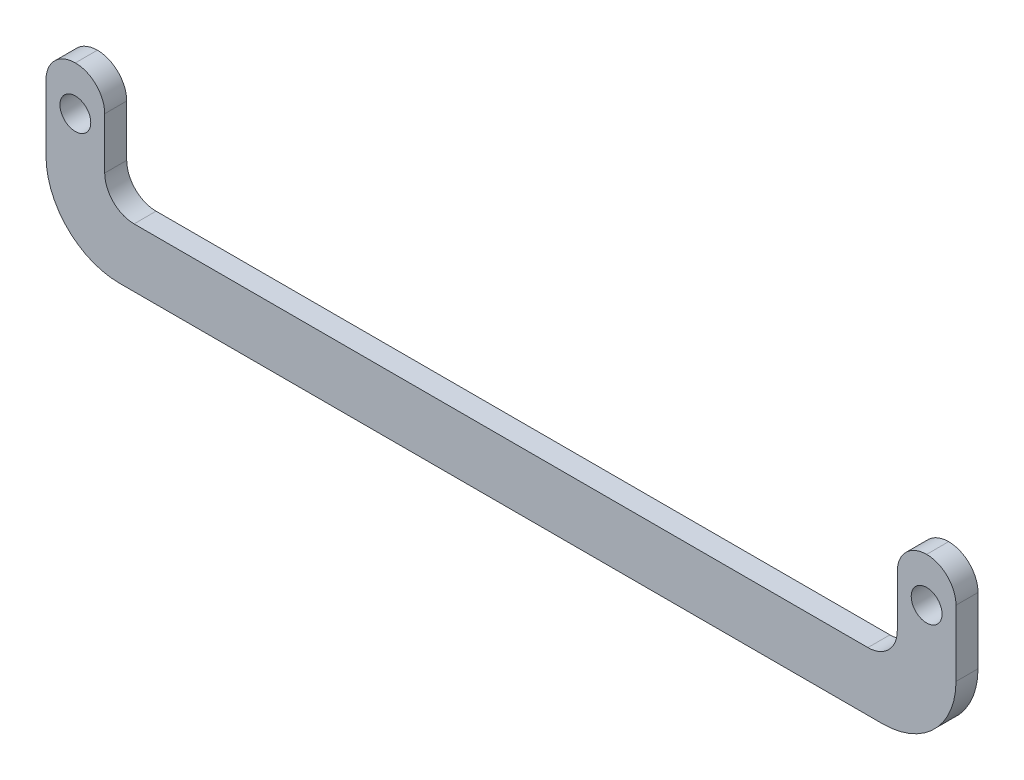
ISO-10303-21;
HEADER;
FILE_DESCRIPTION(('STEP AP214'),'2;1');
FILE_NAME('part.step','',(''),(''),'','','');
FILE_SCHEMA(('AUTOMOTIVE_DESIGN { 1 0 10303 214 1 1 1 1 }'));
ENDSEC;
DATA;
#1=APPLICATION_CONTEXT('core data for automotive mechanical design processes');
#2=APPLICATION_PROTOCOL_DEFINITION('international standard','automotive_design',2000,#1);
#3=PRODUCT_CONTEXT('',#1,'mechanical');
#4=PRODUCT('Part','Part','',(#3));
#5=PRODUCT_RELATED_PRODUCT_CATEGORY('part','',(#4));
#6=PRODUCT_DEFINITION_FORMATION('','',#4);
#7=PRODUCT_DEFINITION_CONTEXT('part definition',#1,'design');
#8=PRODUCT_DEFINITION('design','',#6,#7);
#9=PRODUCT_DEFINITION_SHAPE('','',#8);
#10=(LENGTH_UNIT() NAMED_UNIT(*) SI_UNIT(.MILLI.,.METRE.));
#11=(NAMED_UNIT(*) PLANE_ANGLE_UNIT() SI_UNIT($,.RADIAN.));
#12=(NAMED_UNIT(*) SI_UNIT($,.STERADIAN.) SOLID_ANGLE_UNIT());
#13=UNCERTAINTY_MEASURE_WITH_UNIT(LENGTH_MEASURE(1.E-05),#10,'distance_accuracy_value','');
#14=(GEOMETRIC_REPRESENTATION_CONTEXT(3) GLOBAL_UNCERTAINTY_ASSIGNED_CONTEXT((#13)) GLOBAL_UNIT_ASSIGNED_CONTEXT((#10,
#11,#12)) REPRESENTATION_CONTEXT('',''));
#15=CARTESIAN_POINT('',(0.,0.,0.));
#16=DIRECTION('',(0.,0.,1.));
#17=DIRECTION('',(1.,0.,0.));
#18=AXIS2_PLACEMENT_3D('',#15,#16,#17);
#19=CARTESIAN_POINT('',(-62.,4.,3.));
#20=DIRECTION('',(0.,-1.,0.));
#21=DIRECTION('',(0.,0.,-1.));
#22=AXIS2_PLACEMENT_3D('',#19,#20,#21);
#23=PLANE('',#22);
#24=DIRECTION('',(-1.,0.,0.));
#25=VECTOR('',#24,1.);
#26=CARTESIAN_POINT('',(-62.,4.,0.));
#27=LINE('',#26,#25);
#28=CARTESIAN_POINT('',(50.,4.,0.));
#29=VERTEX_POINT('',#28);
#30=CARTESIAN_POINT('',(-50.,4.,0.));
#31=VERTEX_POINT('',#30);
#32=EDGE_CURVE('E165',#29,#31,#27,.T.);
#33=ORIENTED_EDGE('',*,*,#32,.T.);
#34=DIRECTION('',(0.,0.,1.));
#35=VECTOR('',#34,1.);
#36=CARTESIAN_POINT('',(-50.,4.,3.));
#37=LINE('',#36,#35);
#38=CARTESIAN_POINT('',(-50.,4.,3.));
#39=VERTEX_POINT('',#38);
#40=EDGE_CURVE('E194',#31,#39,#37,.T.);
#41=ORIENTED_EDGE('',*,*,#40,.T.);
#42=DIRECTION('',(-1.,0.,0.));
#43=VECTOR('',#42,1.);
#44=CARTESIAN_POINT('',(-62.,4.,3.));
#45=LINE('',#44,#43);
#46=CARTESIAN_POINT('',(50.,4.,3.));
#47=VERTEX_POINT('',#46);
#48=EDGE_CURVE('E253',#47,#39,#45,.T.);
#49=ORIENTED_EDGE('',*,*,#48,.F.);
#50=DIRECTION('',(0.,0.,1.));
#51=VECTOR('',#50,1.);
#52=CARTESIAN_POINT('',(50.,4.,0.));
#53=LINE('',#52,#51);
#54=EDGE_CURVE('E192',#47,#29,#53,.F.);
#55=ORIENTED_EDGE('',*,*,#54,.T.);
#56=EDGE_LOOP('',(#33,#41,#49,#55));
#57=FACE_BOUND('',#56,.T.);
#58=ADVANCED_FACE('F35',(#57),#23,.F.);
#59=CARTESIAN_POINT('',(62.,-4.,3.));
#60=DIRECTION('',(-1.,0.,0.));
#61=DIRECTION('',(0.,0.,1.));
#62=AXIS2_PLACEMENT_3D('',#59,#60,#61);
#63=PLANE('',#62);
#64=DIRECTION('',(0.,1.,0.));
#65=VECTOR('',#64,1.);
#66=CARTESIAN_POINT('',(62.,-4.,0.));
#67=LINE('',#66,#65);
#68=CARTESIAN_POINT('',(62.,6.,0.));
#69=VERTEX_POINT('',#68);
#70=CARTESIAN_POINT('',(62.,15.,0.));
#71=VERTEX_POINT('',#70);
#72=EDGE_CURVE('E155',#69,#71,#67,.T.);
#73=ORIENTED_EDGE('',*,*,#72,.T.);
#74=DIRECTION('',(0.,0.,1.));
#75=VECTOR('',#74,1.);
#76=CARTESIAN_POINT('',(62.,15.,3.));
#77=LINE('',#76,#75);
#78=CARTESIAN_POINT('',(62.,15.,3.));
#79=VERTEX_POINT('',#78);
#80=EDGE_CURVE('E207',#71,#79,#77,.T.);
#81=ORIENTED_EDGE('',*,*,#80,.T.);
#82=DIRECTION('',(0.,1.,0.));
#83=VECTOR('',#82,1.);
#84=CARTESIAN_POINT('',(62.,-4.,3.));
#85=LINE('',#84,#83);
#86=CARTESIAN_POINT('',(62.,6.,3.));
#87=VERTEX_POINT('',#86);
#88=EDGE_CURVE('E158',#87,#79,#85,.T.);
#89=ORIENTED_EDGE('',*,*,#88,.F.);
#90=DIRECTION('',(0.,0.,-1.));
#91=VECTOR('',#90,1.);
#92=CARTESIAN_POINT('',(62.,6.,3.));
#93=LINE('',#92,#91);
#94=EDGE_CURVE('E142',#87,#69,#93,.T.);
#95=ORIENTED_EDGE('',*,*,#94,.T.);
#96=EDGE_LOOP('',(#73,#81,#89,#95));
#97=FACE_BOUND('',#96,.T.);
#98=ADVANCED_FACE('F153',(#97),#63,.F.);
#99=CARTESIAN_POINT('',(-62.,-4.,3.));
#100=DIRECTION('',(1.,0.,0.));
#101=DIRECTION('',(0.,0.,-1.));
#102=AXIS2_PLACEMENT_3D('',#99,#100,#101);
#103=PLANE('',#102);
#104=DIRECTION('',(0.,-1.,0.));
#105=VECTOR('',#104,1.);
#106=CARTESIAN_POINT('',(-62.,-4.,3.));
#107=LINE('',#106,#105);
#108=CARTESIAN_POINT('',(-62.,15.,3.));
#109=VERTEX_POINT('',#108);
#110=CARTESIAN_POINT('',(-62.,6.,3.));
#111=VERTEX_POINT('',#110);
#112=EDGE_CURVE('E247',#109,#111,#107,.T.);
#113=ORIENTED_EDGE('',*,*,#112,.F.);
#114=DIRECTION('',(0.,0.,1.));
#115=VECTOR('',#114,1.);
#116=CARTESIAN_POINT('',(-62.,15.,0.));
#117=LINE('',#116,#115);
#118=CARTESIAN_POINT('',(-62.,15.,0.));
#119=VERTEX_POINT('',#118);
#120=EDGE_CURVE('E222',#109,#119,#117,.F.);
#121=ORIENTED_EDGE('',*,*,#120,.T.);
#122=DIRECTION('',(0.,-1.,0.));
#123=VECTOR('',#122,1.);
#124=CARTESIAN_POINT('',(-62.,-4.,0.));
#125=LINE('',#124,#123);
#126=CARTESIAN_POINT('',(-62.,6.,0.));
#127=VERTEX_POINT('',#126);
#128=EDGE_CURVE('E169',#119,#127,#125,.T.);
#129=ORIENTED_EDGE('',*,*,#128,.T.);
#130=DIRECTION('',(0.,0.,-1.));
#131=VECTOR('',#130,1.);
#132=CARTESIAN_POINT('',(-62.,6.,3.));
#133=LINE('',#132,#131);
#134=EDGE_CURVE('E189',#127,#111,#133,.F.);
#135=ORIENTED_EDGE('',*,*,#134,.T.);
#136=EDGE_LOOP('',(#113,#121,#129,#135));
#137=FACE_BOUND('',#136,.T.);
#138=ADVANCED_FACE('F250',(#137),#103,.F.);
#139=CARTESIAN_POINT('',(-62.,-4.,3.));
#140=DIRECTION('',(0.,1.,0.));
#141=DIRECTION('',(0.,0.,1.));
#142=AXIS2_PLACEMENT_3D('',#139,#140,#141);
#143=PLANE('',#142);
#144=DIRECTION('',(1.,0.,0.));
#145=VECTOR('',#144,1.);
#146=CARTESIAN_POINT('',(-62.,-4.,0.));
#147=LINE('',#146,#145);
#148=CARTESIAN_POINT('',(-52.,-4.,0.));
#149=VERTEX_POINT('',#148);
#150=CARTESIAN_POINT('',(52.,-4.,0.));
#151=VERTEX_POINT('',#150);
#152=EDGE_CURVE('E178',#149,#151,#147,.T.);
#153=ORIENTED_EDGE('',*,*,#152,.T.);
#154=DIRECTION('',(0.,0.,-1.));
#155=VECTOR('',#154,1.);
#156=CARTESIAN_POINT('',(52.,-4.,3.));
#157=LINE('',#156,#155);
#158=CARTESIAN_POINT('',(52.,-4.,3.));
#159=VERTEX_POINT('',#158);
#160=EDGE_CURVE('E143',#151,#159,#157,.F.);
#161=ORIENTED_EDGE('',*,*,#160,.T.);
#162=DIRECTION('',(1.,0.,0.));
#163=VECTOR('',#162,1.);
#164=CARTESIAN_POINT('',(-62.,-4.,3.));
#165=LINE('',#164,#163);
#166=CARTESIAN_POINT('',(-52.,-4.,3.));
#167=VERTEX_POINT('',#166);
#168=EDGE_CURVE('E159',#167,#159,#165,.T.);
#169=ORIENTED_EDGE('',*,*,#168,.F.);
#170=DIRECTION('',(0.,0.,-1.));
#171=VECTOR('',#170,1.);
#172=CARTESIAN_POINT('',(-52.,-4.,3.));
#173=LINE('',#172,#171);
#174=EDGE_CURVE('E147',#167,#149,#173,.T.);
#175=ORIENTED_EDGE('',*,*,#174,.T.);
#176=EDGE_LOOP('',(#153,#161,#169,#175));
#177=FACE_BOUND('',#176,.T.);
#178=ADVANCED_FACE('F287',(#177),#143,.F.);
#179=CARTESIAN_POINT('',(0.,0.,3.));
#180=DIRECTION('',(0.,0.,-1.));
#181=DIRECTION('',(-1.,0.,0.));
#182=AXIS2_PLACEMENT_3D('',#179,#180,#181);
#183=PLANE('',#182);
#184=CARTESIAN_POINT('',(58.,13.,3.));
#185=DIRECTION('',(0.,0.,-1.));
#186=DIRECTION('',(-1.,0.,0.));
#187=AXIS2_PLACEMENT_3D('',#184,#185,#186);
#188=CIRCLE('',#187,2.1);
#189=CARTESIAN_POINT('',(55.9,13.,3.));
#190=VERTEX_POINT('',#189);
#191=EDGE_CURVE('E230',#190,#190,#188,.T.);
#192=ORIENTED_EDGE('',*,*,#191,.T.);
#193=EDGE_LOOP('',(#192));
#194=FACE_BOUND('',#193,.T.);
#195=ORIENTED_EDGE('',*,*,#88,.T.);
#196=CARTESIAN_POINT('',(58.,15.,3.));
#197=DIRECTION('',(0.,0.,-1.));
#198=DIRECTION('',(-1.,0.,0.));
#199=AXIS2_PLACEMENT_3D('',#196,#197,#198);
#200=CIRCLE('',#199,4.);
#201=CARTESIAN_POINT('',(58.,19.,3.));
#202=VERTEX_POINT('',#201);
#203=EDGE_CURVE('E215',#79,#202,#200,.F.);
#204=ORIENTED_EDGE('',*,*,#203,.T.);
#205=CARTESIAN_POINT('',(58.,15.,3.));
#206=DIRECTION('',(0.,0.,-1.));
#207=DIRECTION('',(-1.,0.,0.));
#208=AXIS2_PLACEMENT_3D('',#205,#206,#207);
#209=CIRCLE('',#208,4.);
#210=CARTESIAN_POINT('',(54.,15.,3.));
#211=VERTEX_POINT('',#210);
#212=EDGE_CURVE('E213',#202,#211,#209,.F.);
#213=ORIENTED_EDGE('',*,*,#212,.T.);
#214=DIRECTION('',(0.,1.,0.));
#215=VECTOR('',#214,1.);
#216=CARTESIAN_POINT('',(54.,-4.,3.));
#217=LINE('',#216,#215);
#218=CARTESIAN_POINT('',(54.,8.,3.));
#219=VERTEX_POINT('',#218);
#220=EDGE_CURVE('E267',#219,#211,#217,.T.);
#221=ORIENTED_EDGE('',*,*,#220,.F.);
#222=CARTESIAN_POINT('',(50.,8.,3.));
#223=DIRECTION('',(0.,0.,-1.));
#224=DIRECTION('',(-1.,0.,0.));
#225=AXIS2_PLACEMENT_3D('',#222,#223,#224);
#226=CIRCLE('',#225,4.);
#227=EDGE_CURVE('E44',#219,#47,#226,.T.);
#228=ORIENTED_EDGE('',*,*,#227,.T.);
#229=ORIENTED_EDGE('',*,*,#48,.T.);
#230=CARTESIAN_POINT('',(-50.,8.,3.));
#231=DIRECTION('',(0.,0.,-1.));
#232=DIRECTION('',(-1.,0.,0.));
#233=AXIS2_PLACEMENT_3D('',#230,#231,#232);
#234=CIRCLE('',#233,4.);
#235=CARTESIAN_POINT('',(-54.,8.,3.));
#236=VERTEX_POINT('',#235);
#237=EDGE_CURVE('E224',#39,#236,#234,.T.);
#238=ORIENTED_EDGE('',*,*,#237,.T.);
#239=DIRECTION('',(0.,1.,0.));
#240=VECTOR('',#239,1.);
#241=CARTESIAN_POINT('',(-54.,-4.,3.));
#242=LINE('',#241,#240);
#243=CARTESIAN_POINT('',(-54.,15.,3.));
#244=VERTEX_POINT('',#243);
#245=EDGE_CURVE('E172',#236,#244,#242,.T.);
#246=ORIENTED_EDGE('',*,*,#245,.T.);
#247=CARTESIAN_POINT('',(-58.,15.,3.));
#248=DIRECTION('',(0.,0.,-1.));
#249=DIRECTION('',(-1.,0.,0.));
#250=AXIS2_PLACEMENT_3D('',#247,#248,#249);
#251=CIRCLE('',#250,4.);
#252=CARTESIAN_POINT('',(-58.,19.,3.));
#253=VERTEX_POINT('',#252);
#254=EDGE_CURVE('E211',#244,#253,#251,.F.);
#255=ORIENTED_EDGE('',*,*,#254,.T.);
#256=CARTESIAN_POINT('',(-58.,15.,3.));
#257=DIRECTION('',(0.,0.,-1.));
#258=DIRECTION('',(-1.,0.,0.));
#259=AXIS2_PLACEMENT_3D('',#256,#257,#258);
#260=CIRCLE('',#259,4.);
#261=EDGE_CURVE('E209',#253,#109,#260,.F.);
#262=ORIENTED_EDGE('',*,*,#261,.T.);
#263=ORIENTED_EDGE('',*,*,#112,.T.);
#264=CARTESIAN_POINT('',(-52.,6.,3.));
#265=DIRECTION('',(0.,0.,-1.));
#266=DIRECTION('',(-1.,0.,0.));
#267=AXIS2_PLACEMENT_3D('',#264,#265,#266);
#268=CIRCLE('',#267,10.);
#269=EDGE_CURVE('E185',#111,#167,#268,.F.);
#270=ORIENTED_EDGE('',*,*,#269,.T.);
#271=ORIENTED_EDGE('',*,*,#168,.T.);
#272=CARTESIAN_POINT('',(52.,6.,3.));
#273=DIRECTION('',(0.,0.,-1.));
#274=DIRECTION('',(-1.,0.,0.));
#275=AXIS2_PLACEMENT_3D('',#272,#273,#274);
#276=CIRCLE('',#275,10.);
#277=EDGE_CURVE('E187',#159,#87,#276,.F.);
#278=ORIENTED_EDGE('',*,*,#277,.T.);
#279=EDGE_LOOP('',(#195,#204,#213,#221,#228,#229,#238,#246,#255,#262,#263,#270,#271,#278));
#280=FACE_BOUND('',#279,.T.);
#281=CARTESIAN_POINT('',(-58.,13.,3.));
#282=DIRECTION('',(0.,0.,1.));
#283=DIRECTION('',(1.,0.,0.));
#284=AXIS2_PLACEMENT_3D('',#281,#282,#283);
#285=CIRCLE('',#284,2.1);
#286=CARTESIAN_POINT('',(-55.9,13.,3.));
#287=VERTEX_POINT('',#286);
#288=EDGE_CURVE('E261',#287,#287,#285,.T.);
#289=ORIENTED_EDGE('',*,*,#288,.F.);
#290=EDGE_LOOP('',(#289));
#291=FACE_BOUND('',#290,.T.);
#292=ADVANCED_FACE('F245',(#194,#280,#291),#183,.F.);
#293=CARTESIAN_POINT('',(0.,0.,0.));
#294=DIRECTION('',(0.,0.,-1.));
#295=DIRECTION('',(-1.,0.,0.));
#296=AXIS2_PLACEMENT_3D('',#293,#294,#295);
#297=PLANE('',#296);
#298=CARTESIAN_POINT('',(58.,13.,0.));
#299=DIRECTION('',(0.,0.,-1.));
#300=DIRECTION('',(-1.,0.,0.));
#301=AXIS2_PLACEMENT_3D('',#298,#299,#300);
#302=CIRCLE('',#301,2.1);
#303=CARTESIAN_POINT('',(55.9,13.,0.));
#304=VERTEX_POINT('',#303);
#305=EDGE_CURVE('E233',#304,#304,#302,.T.);
#306=ORIENTED_EDGE('',*,*,#305,.F.);
#307=EDGE_LOOP('',(#306));
#308=FACE_BOUND('',#307,.T.);
#309=CARTESIAN_POINT('',(58.,15.,0.));
#310=DIRECTION('',(0.,0.,-1.));
#311=DIRECTION('',(-1.,0.,0.));
#312=AXIS2_PLACEMENT_3D('',#309,#310,#311);
#313=CIRCLE('',#312,4.);
#314=CARTESIAN_POINT('',(54.,15.,0.));
#315=VERTEX_POINT('',#314);
#316=CARTESIAN_POINT('',(58.,19.,0.));
#317=VERTEX_POINT('',#316);
#318=EDGE_CURVE('E52',#315,#317,#313,.T.);
#319=ORIENTED_EDGE('',*,*,#318,.T.);
#320=CARTESIAN_POINT('',(58.,15.,0.));
#321=DIRECTION('',(0.,0.,-1.));
#322=DIRECTION('',(-1.,0.,0.));
#323=AXIS2_PLACEMENT_3D('',#320,#321,#322);
#324=CIRCLE('',#323,4.);
#325=EDGE_CURVE('E164',#317,#71,#324,.T.);
#326=ORIENTED_EDGE('',*,*,#325,.T.);
#327=ORIENTED_EDGE('',*,*,#72,.F.);
#328=CARTESIAN_POINT('',(52.,6.,0.));
#329=DIRECTION('',(0.,0.,-1.));
#330=DIRECTION('',(-1.,0.,0.));
#331=AXIS2_PLACEMENT_3D('',#328,#329,#330);
#332=CIRCLE('',#331,10.);
#333=EDGE_CURVE('E138',#69,#151,#332,.T.);
#334=ORIENTED_EDGE('',*,*,#333,.T.);
#335=ORIENTED_EDGE('',*,*,#152,.F.);
#336=CARTESIAN_POINT('',(-52.,6.,0.));
#337=DIRECTION('',(0.,0.,-1.));
#338=DIRECTION('',(-1.,0.,0.));
#339=AXIS2_PLACEMENT_3D('',#336,#337,#338);
#340=CIRCLE('',#339,10.);
#341=EDGE_CURVE('E148',#149,#127,#340,.T.);
#342=ORIENTED_EDGE('',*,*,#341,.T.);
#343=ORIENTED_EDGE('',*,*,#128,.F.);
#344=CARTESIAN_POINT('',(-58.,15.,0.));
#345=DIRECTION('',(0.,0.,-1.));
#346=DIRECTION('',(-1.,0.,0.));
#347=AXIS2_PLACEMENT_3D('',#344,#345,#346);
#348=CIRCLE('',#347,4.);
#349=CARTESIAN_POINT('',(-58.,19.,0.));
#350=VERTEX_POINT('',#349);
#351=EDGE_CURVE('E59',#119,#350,#348,.T.);
#352=ORIENTED_EDGE('',*,*,#351,.T.);
#353=CARTESIAN_POINT('',(-58.,15.,0.));
#354=DIRECTION('',(0.,0.,-1.));
#355=DIRECTION('',(-1.,0.,0.));
#356=AXIS2_PLACEMENT_3D('',#353,#354,#355);
#357=CIRCLE('',#356,4.);
#358=CARTESIAN_POINT('',(-54.,15.,0.));
#359=VERTEX_POINT('',#358);
#360=EDGE_CURVE('E218',#350,#359,#357,.T.);
#361=ORIENTED_EDGE('',*,*,#360,.T.);
#362=DIRECTION('',(0.,1.,0.));
#363=VECTOR('',#362,1.);
#364=CARTESIAN_POINT('',(-54.,-4.,0.));
#365=LINE('',#364,#363);
#366=CARTESIAN_POINT('',(-54.,8.,0.));
#367=VERTEX_POINT('',#366);
#368=EDGE_CURVE('E166',#367,#359,#365,.T.);
#369=ORIENTED_EDGE('',*,*,#368,.F.);
#370=CARTESIAN_POINT('',(-50.,8.,0.));
#371=DIRECTION('',(0.,0.,-1.));
#372=DIRECTION('',(-1.,0.,0.));
#373=AXIS2_PLACEMENT_3D('',#370,#371,#372);
#374=CIRCLE('',#373,4.);
#375=EDGE_CURVE('E226',#367,#31,#374,.F.);
#376=ORIENTED_EDGE('',*,*,#375,.T.);
#377=ORIENTED_EDGE('',*,*,#32,.F.);
#378=CARTESIAN_POINT('',(50.,8.,0.));
#379=DIRECTION('',(0.,0.,-1.));
#380=DIRECTION('',(-1.,0.,0.));
#381=AXIS2_PLACEMENT_3D('',#378,#379,#380);
#382=CIRCLE('',#381,4.);
#383=CARTESIAN_POINT('',(54.,8.,0.));
#384=VERTEX_POINT('',#383);
#385=EDGE_CURVE('E11',#29,#384,#382,.F.);
#386=ORIENTED_EDGE('',*,*,#385,.T.);
#387=DIRECTION('',(0.,1.,0.));
#388=VECTOR('',#387,1.);
#389=CARTESIAN_POINT('',(54.,-4.,0.));
#390=LINE('',#389,#388);
#391=EDGE_CURVE('E264',#384,#315,#390,.T.);
#392=ORIENTED_EDGE('',*,*,#391,.T.);
#393=EDGE_LOOP('',(#319,#326,#327,#334,#335,#342,#343,#352,#361,#369,#376,#377,#386,#392));
#394=FACE_BOUND('',#393,.T.);
#395=CARTESIAN_POINT('',(-58.,13.,0.));
#396=DIRECTION('',(0.,0.,1.));
#397=DIRECTION('',(1.,0.,0.));
#398=AXIS2_PLACEMENT_3D('',#395,#396,#397);
#399=CIRCLE('',#398,2.1);
#400=CARTESIAN_POINT('',(-55.9,13.,0.));
#401=VERTEX_POINT('',#400);
#402=EDGE_CURVE('E259',#401,#401,#399,.T.);
#403=ORIENTED_EDGE('',*,*,#402,.T.);
#404=EDGE_LOOP('',(#403));
#405=FACE_BOUND('',#404,.T.);
#406=ADVANCED_FACE('F161',(#308,#394,#405),#297,.T.);
#407=CARTESIAN_POINT('',(-54.,-4.,0.));
#408=DIRECTION('',(1.,0.,0.));
#409=DIRECTION('',(0.,0.,-1.));
#410=AXIS2_PLACEMENT_3D('',#407,#408,#409);
#411=PLANE('',#410);
#412=ORIENTED_EDGE('',*,*,#245,.F.);
#413=DIRECTION('',(0.,0.,1.));
#414=VECTOR('',#413,1.);
#415=CARTESIAN_POINT('',(-54.,8.,0.));
#416=LINE('',#415,#414);
#417=EDGE_CURVE('E200',#236,#367,#416,.F.);
#418=ORIENTED_EDGE('',*,*,#417,.T.);
#419=ORIENTED_EDGE('',*,*,#368,.T.);
#420=DIRECTION('',(0.,0.,1.));
#421=VECTOR('',#420,1.);
#422=CARTESIAN_POINT('',(-54.,15.,0.));
#423=LINE('',#422,#421);
#424=EDGE_CURVE('E197',#359,#244,#423,.T.);
#425=ORIENTED_EDGE('',*,*,#424,.T.);
#426=EDGE_LOOP('',(#412,#418,#419,#425));
#427=FACE_BOUND('',#426,.T.);
#428=ADVANCED_FACE('F278',(#427),#411,.T.);
#429=CARTESIAN_POINT('',(-58.,13.,0.));
#430=DIRECTION('',(0.,0.,1.));
#431=DIRECTION('',(1.,0.,0.));
#432=AXIS2_PLACEMENT_3D('',#429,#430,#431);
#433=CYLINDRICAL_SURFACE('',#432,2.1);
#434=ORIENTED_EDGE('',*,*,#402,.F.);
#435=EDGE_LOOP('',(#434));
#436=FACE_BOUND('',#435,.T.);
#437=ORIENTED_EDGE('',*,*,#288,.T.);
#438=EDGE_LOOP('',(#437));
#439=FACE_BOUND('',#438,.T.);
#440=ADVANCED_FACE('F284',(#436,#439),#433,.F.);
#441=CARTESIAN_POINT('',(54.,-4.,0.));
#442=DIRECTION('',(1.,0.,0.));
#443=DIRECTION('',(0.,0.,-1.));
#444=AXIS2_PLACEMENT_3D('',#441,#442,#443);
#445=PLANE('',#444);
#446=ORIENTED_EDGE('',*,*,#391,.F.);
#447=DIRECTION('',(0.,0.,1.));
#448=VECTOR('',#447,1.);
#449=CARTESIAN_POINT('',(54.,8.,3.));
#450=LINE('',#449,#448);
#451=EDGE_CURVE('E204',#384,#219,#450,.T.);
#452=ORIENTED_EDGE('',*,*,#451,.T.);
#453=ORIENTED_EDGE('',*,*,#220,.T.);
#454=DIRECTION('',(0.,0.,1.));
#455=VECTOR('',#454,1.);
#456=CARTESIAN_POINT('',(54.,15.,0.));
#457=LINE('',#456,#455);
#458=EDGE_CURVE('E202',#211,#315,#457,.F.);
#459=ORIENTED_EDGE('',*,*,#458,.T.);
#460=EDGE_LOOP('',(#446,#452,#453,#459));
#461=FACE_BOUND('',#460,.T.);
#462=ADVANCED_FACE('F358',(#461),#445,.F.);
#463=CARTESIAN_POINT('',(58.,13.,0.));
#464=DIRECTION('',(0.,0.,1.));
#465=DIRECTION('',(1.,0.,0.));
#466=AXIS2_PLACEMENT_3D('',#463,#464,#465);
#467=CYLINDRICAL_SURFACE('',#466,2.1);
#468=ORIENTED_EDGE('',*,*,#305,.T.);
#469=EDGE_LOOP('',(#468));
#470=FACE_BOUND('',#469,.T.);
#471=ORIENTED_EDGE('',*,*,#191,.F.);
#472=EDGE_LOOP('',(#471));
#473=FACE_BOUND('',#472,.T.);
#474=ADVANCED_FACE('F274',(#470,#473),#467,.F.);
#475=CARTESIAN_POINT('',(52.,6.,3.));
#476=DIRECTION('',(0.,0.,-1.));
#477=DIRECTION('',(-1.,0.,0.));
#478=AXIS2_PLACEMENT_3D('',#475,#476,#477);
#479=CYLINDRICAL_SURFACE('',#478,10.);
#480=ORIENTED_EDGE('',*,*,#277,.F.);
#481=ORIENTED_EDGE('',*,*,#160,.F.);
#482=ORIENTED_EDGE('',*,*,#333,.F.);
#483=ORIENTED_EDGE('',*,*,#94,.F.);
#484=EDGE_LOOP('',(#480,#481,#482,#483));
#485=FACE_BOUND('',#484,.T.);
#486=ADVANCED_FACE('F141',(#485),#479,.T.);
#487=CARTESIAN_POINT('',(-52.,6.,3.));
#488=DIRECTION('',(0.,0.,-1.));
#489=DIRECTION('',(-1.,0.,0.));
#490=AXIS2_PLACEMENT_3D('',#487,#488,#489);
#491=CYLINDRICAL_SURFACE('',#490,10.);
#492=ORIENTED_EDGE('',*,*,#269,.F.);
#493=ORIENTED_EDGE('',*,*,#134,.F.);
#494=ORIENTED_EDGE('',*,*,#341,.F.);
#495=ORIENTED_EDGE('',*,*,#174,.F.);
#496=EDGE_LOOP('',(#492,#493,#494,#495));
#497=FACE_BOUND('',#496,.T.);
#498=ADVANCED_FACE('F302',(#497),#491,.T.);
#499=CARTESIAN_POINT('',(-50.,8.,3.));
#500=DIRECTION('',(0.,0.,1.));
#501=DIRECTION('',(1.,0.,0.));
#502=AXIS2_PLACEMENT_3D('',#499,#500,#501);
#503=CYLINDRICAL_SURFACE('',#502,4.);
#504=ORIENTED_EDGE('',*,*,#375,.F.);
#505=ORIENTED_EDGE('',*,*,#417,.F.);
#506=ORIENTED_EDGE('',*,*,#237,.F.);
#507=ORIENTED_EDGE('',*,*,#40,.F.);
#508=EDGE_LOOP('',(#504,#505,#506,#507));
#509=FACE_BOUND('',#508,.T.);
#510=ADVANCED_FACE('F305',(#509),#503,.F.);
#511=CARTESIAN_POINT('',(50.,8.,0.));
#512=DIRECTION('',(0.,0.,-1.));
#513=DIRECTION('',(-1.,0.,0.));
#514=AXIS2_PLACEMENT_3D('',#511,#512,#513);
#515=CYLINDRICAL_SURFACE('',#514,4.);
#516=ORIENTED_EDGE('',*,*,#385,.F.);
#517=ORIENTED_EDGE('',*,*,#54,.F.);
#518=ORIENTED_EDGE('',*,*,#227,.F.);
#519=ORIENTED_EDGE('',*,*,#451,.F.);
#520=EDGE_LOOP('',(#516,#517,#518,#519));
#521=FACE_BOUND('',#520,.T.);
#522=ADVANCED_FACE('F309',(#521),#515,.F.);
#523=CARTESIAN_POINT('',(58.,15.,0.));
#524=DIRECTION('',(0.,0.,1.));
#525=DIRECTION('',(1.,0.,0.));
#526=AXIS2_PLACEMENT_3D('',#523,#524,#525);
#527=CYLINDRICAL_SURFACE('',#526,4.);
#528=DIRECTION('',(0.,0.,1.));
#529=VECTOR('',#528,1.);
#530=CARTESIAN_POINT('',(58.,19.,0.));
#531=LINE('',#530,#529);
#532=EDGE_CURVE('E228',#317,#202,#531,.T.);
#533=ORIENTED_EDGE('',*,*,#532,.F.);
#534=ORIENTED_EDGE('',*,*,#318,.F.);
#535=ORIENTED_EDGE('',*,*,#458,.F.);
#536=ORIENTED_EDGE('',*,*,#212,.F.);
#537=EDGE_LOOP('',(#533,#534,#535,#536));
#538=FACE_BOUND('',#537,.T.);
#539=ADVANCED_FACE('F313',(#538),#527,.T.);
#540=CARTESIAN_POINT('',(58.,15.,3.));
#541=DIRECTION('',(0.,0.,1.));
#542=DIRECTION('',(1.,0.,0.));
#543=AXIS2_PLACEMENT_3D('',#540,#541,#542);
#544=CYLINDRICAL_SURFACE('',#543,4.);
#545=ORIENTED_EDGE('',*,*,#325,.F.);
#546=ORIENTED_EDGE('',*,*,#532,.T.);
#547=ORIENTED_EDGE('',*,*,#203,.F.);
#548=ORIENTED_EDGE('',*,*,#80,.F.);
#549=EDGE_LOOP('',(#545,#546,#547,#548));
#550=FACE_BOUND('',#549,.T.);
#551=ADVANCED_FACE('F315',(#550),#544,.T.);
#552=CARTESIAN_POINT('',(-58.,15.,0.));
#553=DIRECTION('',(0.,0.,-1.));
#554=DIRECTION('',(-1.,0.,0.));
#555=AXIS2_PLACEMENT_3D('',#552,#553,#554);
#556=CYLINDRICAL_SURFACE('',#555,4.);
#557=DIRECTION('',(0.,0.,1.));
#558=VECTOR('',#557,1.);
#559=CARTESIAN_POINT('',(-58.,19.,3.));
#560=LINE('',#559,#558);
#561=EDGE_CURVE('E39',#350,#253,#560,.T.);
#562=ORIENTED_EDGE('',*,*,#561,.F.);
#563=ORIENTED_EDGE('',*,*,#351,.F.);
#564=ORIENTED_EDGE('',*,*,#120,.F.);
#565=ORIENTED_EDGE('',*,*,#261,.F.);
#566=EDGE_LOOP('',(#562,#563,#564,#565));
#567=FACE_BOUND('',#566,.T.);
#568=ADVANCED_FACE('F37',(#567),#556,.T.);
#569=CARTESIAN_POINT('',(-58.,15.,0.));
#570=DIRECTION('',(0.,0.,1.));
#571=DIRECTION('',(1.,0.,0.));
#572=AXIS2_PLACEMENT_3D('',#569,#570,#571);
#573=CYLINDRICAL_SURFACE('',#572,4.);
#574=ORIENTED_EDGE('',*,*,#360,.F.);
#575=ORIENTED_EDGE('',*,*,#561,.T.);
#576=ORIENTED_EDGE('',*,*,#254,.F.);
#577=ORIENTED_EDGE('',*,*,#424,.F.);
#578=EDGE_LOOP('',(#574,#575,#576,#577));
#579=FACE_BOUND('',#578,.T.);
#580=ADVANCED_FACE('F238',(#579),#573,.T.);
#581=CLOSED_SHELL('',(#58,#98,#138,#178,#292,#406,#428,#440,#462,#474,#486,#498,#510,#522,#539,
#551,#568,#580));
#582=MANIFOLD_SOLID_BREP('B2',#581);
#583=ADVANCED_BREP_SHAPE_REPRESENTATION('',(#18,#582),#14);
#584=SHAPE_DEFINITION_REPRESENTATION(#9,#583);
ENDSEC;
END-ISO-10303-21;
